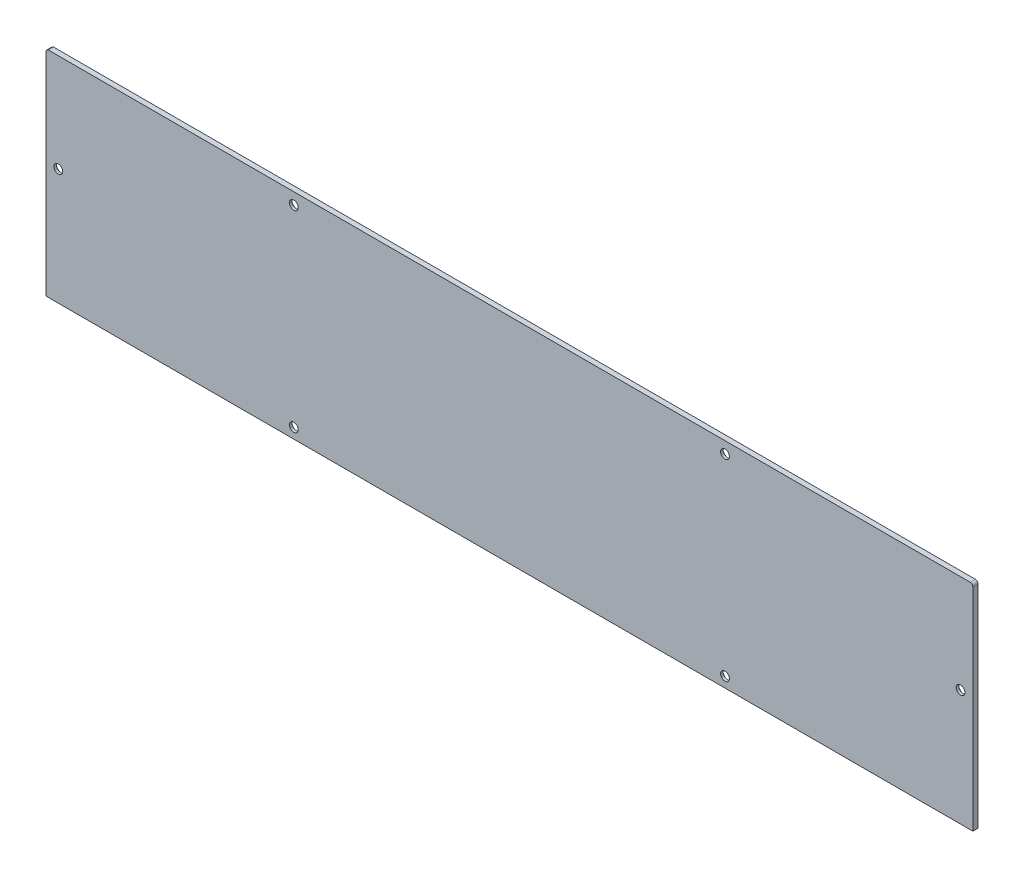
ISO-10303-21;
HEADER;
FILE_DESCRIPTION(('STEP AP214'),'2;1');
FILE_NAME('part.step','',(''),(''),'','','');
FILE_SCHEMA(('AUTOMOTIVE_DESIGN { 1 0 10303 214 1 1 1 1 }'));
ENDSEC;
DATA;
#1=APPLICATION_CONTEXT('core data for automotive mechanical design processes');
#2=APPLICATION_PROTOCOL_DEFINITION('international standard','automotive_design',2000,#1);
#3=PRODUCT_CONTEXT('',#1,'mechanical');
#4=PRODUCT('Part','Part','',(#3));
#5=PRODUCT_RELATED_PRODUCT_CATEGORY('part','',(#4));
#6=PRODUCT_DEFINITION_FORMATION('','',#4);
#7=PRODUCT_DEFINITION_CONTEXT('part definition',#1,'design');
#8=PRODUCT_DEFINITION('design','',#6,#7);
#9=PRODUCT_DEFINITION_SHAPE('','',#8);
#10=(LENGTH_UNIT() NAMED_UNIT(*) SI_UNIT(.MILLI.,.METRE.));
#11=(NAMED_UNIT(*) PLANE_ANGLE_UNIT() SI_UNIT($,.RADIAN.));
#12=(NAMED_UNIT(*) SI_UNIT($,.STERADIAN.) SOLID_ANGLE_UNIT());
#13=UNCERTAINTY_MEASURE_WITH_UNIT(LENGTH_MEASURE(1.E-05),#10,'distance_accuracy_value','');
#14=(GEOMETRIC_REPRESENTATION_CONTEXT(3) GLOBAL_UNCERTAINTY_ASSIGNED_CONTEXT((#13)) GLOBAL_UNIT_ASSIGNED_CONTEXT((#10,
#11,#12)) REPRESENTATION_CONTEXT('',''));
#15=CARTESIAN_POINT('',(0.,0.,0.));
#16=DIRECTION('',(0.,0.,1.));
#17=DIRECTION('',(1.,0.,0.));
#18=AXIS2_PLACEMENT_3D('',#15,#16,#17);
#19=CARTESIAN_POINT('',(76.2518692933662,-10.,220.724508868488));
#20=DIRECTION('',(0.,1.,0.));
#21=DIRECTION('',(-1.,0.,0.));
#22=AXIS2_PLACEMENT_3D('',#19,#20,#21);
#23=PLANE('',#22);
#24=DIRECTION('',(-1.,0.,0.));
#25=VECTOR('',#24,1.);
#26=CARTESIAN_POINT('',(76.2518692933662,-10.,222.724508868488));
#27=LINE('',#26,#25);
#28=CARTESIAN_POINT('',(76.2518692933662,-9.99999999999999,222.724508868488));
#29=VERTEX_POINT('',#28);
#30=CARTESIAN_POINT('',(-282.750233779396,-9.99999999999996,222.724508868488));
#31=VERTEX_POINT('',#30);
#32=EDGE_CURVE('E43',#29,#31,#27,.T.);
#33=ORIENTED_EDGE('',*,*,#32,.T.);
#34=DIRECTION('',(0.,0.,-1.));
#35=VECTOR('',#34,1.);
#36=CARTESIAN_POINT('',(-282.750233779396,-9.99999999999996,591.19636669574));
#37=LINE('',#36,#35);
#38=CARTESIAN_POINT('',(-282.750233779396,-9.99999999999996,220.724508868488));
#39=VERTEX_POINT('',#38);
#40=EDGE_CURVE('E99',#31,#39,#37,.T.);
#41=ORIENTED_EDGE('',*,*,#40,.T.);
#42=DIRECTION('',(-1.,0.,0.));
#43=VECTOR('',#42,1.);
#44=CARTESIAN_POINT('',(76.2518692933662,-10.,220.724508868488));
#45=LINE('',#44,#43);
#46=CARTESIAN_POINT('',(76.2518692933662,-9.99999999999999,220.724508868488));
#47=VERTEX_POINT('',#46);
#48=EDGE_CURVE('E11',#47,#39,#45,.T.);
#49=ORIENTED_EDGE('',*,*,#48,.F.);
#50=DIRECTION('',(0.,0.,-1.));
#51=VECTOR('',#50,1.);
#52=CARTESIAN_POINT('',(76.2518692933661,-9.99999999999999,591.19636669574));
#53=LINE('',#52,#51);
#54=EDGE_CURVE('E121',#29,#47,#53,.T.);
#55=ORIENTED_EDGE('',*,*,#54,.F.);
#56=EDGE_LOOP('',(#33,#41,#49,#55));
#57=FACE_BOUND('',#56,.T.);
#58=ADVANCED_FACE('F35',(#57),#23,.F.);
#59=CARTESIAN_POINT('',(73.2518692933661,70.,220.724508868488));
#60=DIRECTION('',(0.,0.,-1.));
#61=DIRECTION('',(-1.,0.,0.));
#62=AXIS2_PLACEMENT_3D('',#59,#60,#61);
#63=PLANE('',#62);
#64=ORIENTED_EDGE('',*,*,#48,.T.);
#65=DIRECTION('',(0.,1.,0.));
#66=VECTOR('',#65,1.);
#67=CARTESIAN_POINT('',(-282.750233779396,-9.99999999999996,220.724508868488));
#68=LINE('',#67,#66);
#69=CARTESIAN_POINT('',(-282.750233779396,72.,220.724508868488));
#70=VERTEX_POINT('',#69);
#71=EDGE_CURVE('E91',#39,#70,#68,.T.);
#72=ORIENTED_EDGE('',*,*,#71,.T.);
#73=CARTESIAN_POINT('',(-281.750233779396,72.,220.724508868488));
#74=DIRECTION('',(0.,0.,-1.));
#75=DIRECTION('',(-1.,0.,0.));
#76=AXIS2_PLACEMENT_3D('',#73,#74,#75);
#77=CIRCLE('',#76,1.);
#78=CARTESIAN_POINT('',(-281.750233779396,73.,220.724508868488));
#79=VERTEX_POINT('',#78);
#80=EDGE_CURVE('E108',#70,#79,#77,.T.);
#81=ORIENTED_EDGE('',*,*,#80,.T.);
#82=DIRECTION('',(1.,0.,0.));
#83=VECTOR('',#82,1.);
#84=CARTESIAN_POINT('',(-281.750233779396,73.,220.724508868488));
#85=LINE('',#84,#83);
#86=CARTESIAN_POINT('',(75.2518692933662,73.,220.724508868488));
#87=VERTEX_POINT('',#86);
#88=EDGE_CURVE('E110',#79,#87,#85,.T.);
#89=ORIENTED_EDGE('',*,*,#88,.T.);
#90=CARTESIAN_POINT('',(75.2518692933662,72.,220.724508868488));
#91=DIRECTION('',(0.,0.,-1.));
#92=DIRECTION('',(1.,0.,0.));
#93=AXIS2_PLACEMENT_3D('',#90,#91,#92);
#94=CIRCLE('',#93,1.);
#95=CARTESIAN_POINT('',(76.2518692933662,72.,220.724508868488));
#96=VERTEX_POINT('',#95);
#97=EDGE_CURVE('E118',#87,#96,#94,.T.);
#98=ORIENTED_EDGE('',*,*,#97,.T.);
#99=DIRECTION('',(0.,-1.,0.));
#100=VECTOR('',#99,1.);
#101=CARTESIAN_POINT('',(76.2518692933662,72.,220.724508868488));
#102=LINE('',#101,#100);
#103=EDGE_CURVE('E94',#96,#47,#102,.T.);
#104=ORIENTED_EDGE('',*,*,#103,.T.);
#105=EDGE_LOOP('',(#64,#72,#81,#89,#98,#104));
#106=FACE_BOUND('',#105,.T.);
#107=CARTESIAN_POINT('',(-19.7491822429967,-6.0000000000002,220.724508868478));
#108=DIRECTION('',(0.,0.,-1.));
#109=DIRECTION('',(-1.,0.,0.));
#110=AXIS2_PLACEMENT_3D('',#107,#108,#109);
#111=CIRCLE('',#110,3.);
#112=CARTESIAN_POINT('',(-22.7491822429967,-6.0000000000002,220.724508868478));
#113=VERTEX_POINT('',#112);
#114=EDGE_CURVE('E133',#113,#113,#111,.T.);
#115=ORIENTED_EDGE('',*,*,#114,.F.);
#116=EDGE_LOOP('',(#115));
#117=FACE_BOUND('',#116,.T.);
#118=CARTESIAN_POINT('',(-186.749182242997,-6.0000000000002,220.724508868478));
#119=DIRECTION('',(0.,0.,-1.));
#120=DIRECTION('',(-1.,0.,0.));
#121=AXIS2_PLACEMENT_3D('',#118,#119,#120);
#122=CIRCLE('',#121,3.);
#123=CARTESIAN_POINT('',(-189.749182242997,-6.0000000000002,220.724508868478));
#124=VERTEX_POINT('',#123);
#125=EDGE_CURVE('E142',#124,#124,#122,.T.);
#126=ORIENTED_EDGE('',*,*,#125,.F.);
#127=EDGE_LOOP('',(#126));
#128=FACE_BOUND('',#127,.T.);
#129=CARTESIAN_POINT('',(71.5018692933754,34.9999999999999,220.724508868488));
#130=DIRECTION('',(0.,0.,-1.));
#131=DIRECTION('',(-1.,0.,0.));
#132=AXIS2_PLACEMENT_3D('',#129,#130,#131);
#133=CIRCLE('',#132,3.);
#134=CARTESIAN_POINT('',(68.5018692933754,34.9999999999999,220.724508868488));
#135=VERTEX_POINT('',#134);
#136=EDGE_CURVE('E152',#135,#135,#133,.T.);
#137=ORIENTED_EDGE('',*,*,#136,.F.);
#138=EDGE_LOOP('',(#137));
#139=FACE_BOUND('',#138,.T.);
#140=CARTESIAN_POINT('',(-19.7491822430078,68.5,220.724508868488));
#141=DIRECTION('',(0.,0.,-1.));
#142=DIRECTION('',(-1.,0.,0.));
#143=AXIS2_PLACEMENT_3D('',#140,#141,#142);
#144=CIRCLE('',#143,3.);
#145=CARTESIAN_POINT('',(-22.7491822430078,68.5,220.724508868488));
#146=VERTEX_POINT('',#145);
#147=EDGE_CURVE('E162',#146,#146,#144,.T.);
#148=ORIENTED_EDGE('',*,*,#147,.F.);
#149=EDGE_LOOP('',(#148));
#150=FACE_BOUND('',#149,.T.);
#151=CARTESIAN_POINT('',(-186.749182243015,68.4999999999999,220.724508868488));
#152=DIRECTION('',(0.,0.,-1.));
#153=DIRECTION('',(-1.,0.,0.));
#154=AXIS2_PLACEMENT_3D('',#151,#152,#153);
#155=CIRCLE('',#154,3.);
#156=CARTESIAN_POINT('',(-189.749182243015,68.4999999999999,220.724508868488));
#157=VERTEX_POINT('',#156);
#158=EDGE_CURVE('E172',#157,#157,#155,.T.);
#159=ORIENTED_EDGE('',*,*,#158,.F.);
#160=EDGE_LOOP('',(#159));
#161=FACE_BOUND('',#160,.T.);
#162=CARTESIAN_POINT('',(-278.000233779387,35.,220.724508868488));
#163=DIRECTION('',(0.,0.,-1.));
#164=DIRECTION('',(-1.,0.,0.));
#165=AXIS2_PLACEMENT_3D('',#162,#163,#164);
#166=CIRCLE('',#165,3.);
#167=CARTESIAN_POINT('',(-281.000233779387,35.,220.724508868488));
#168=VERTEX_POINT('',#167);
#169=EDGE_CURVE('E182',#168,#168,#166,.T.);
#170=ORIENTED_EDGE('',*,*,#169,.F.);
#171=EDGE_LOOP('',(#170));
#172=FACE_BOUND('',#171,.T.);
#173=ADVANCED_FACE('F87',(#106,#117,#128,#139,#150,#161,#172),#63,.T.);
#174=CARTESIAN_POINT('',(73.2518692933661,70.,222.724508868488));
#175=DIRECTION('',(0.,0.,-1.));
#176=DIRECTION('',(-1.,0.,0.));
#177=AXIS2_PLACEMENT_3D('',#174,#175,#176);
#178=PLANE('',#177);
#179=DIRECTION('',(0.,-1.,0.));
#180=VECTOR('',#179,1.);
#181=CARTESIAN_POINT('',(-282.750233779396,-9.99999999999996,222.724508868488));
#182=LINE('',#181,#180);
#183=CARTESIAN_POINT('',(-282.750233779396,72.,222.724508868488));
#184=VERTEX_POINT('',#183);
#185=EDGE_CURVE('E131',#184,#31,#182,.T.);
#186=ORIENTED_EDGE('',*,*,#185,.T.);
#187=ORIENTED_EDGE('',*,*,#32,.F.);
#188=DIRECTION('',(0.,1.,0.));
#189=VECTOR('',#188,1.);
#190=CARTESIAN_POINT('',(76.2518692933662,72.,222.724508868488));
#191=LINE('',#190,#189);
#192=CARTESIAN_POINT('',(76.2518692933662,72.,222.724508868488));
#193=VERTEX_POINT('',#192);
#194=EDGE_CURVE('E113',#29,#193,#191,.T.);
#195=ORIENTED_EDGE('',*,*,#194,.T.);
#196=CARTESIAN_POINT('',(75.2518692933662,72.,222.724508868488));
#197=DIRECTION('',(0.,0.,-1.));
#198=DIRECTION('',(-1.,0.,0.));
#199=AXIS2_PLACEMENT_3D('',#196,#197,#198);
#200=CIRCLE('',#199,1.);
#201=CARTESIAN_POINT('',(75.2518692933662,73.,222.724508868488));
#202=VERTEX_POINT('',#201);
#203=EDGE_CURVE('E56',#193,#202,#200,.F.);
#204=ORIENTED_EDGE('',*,*,#203,.T.);
#205=DIRECTION('',(-1.,0.,0.));
#206=VECTOR('',#205,1.);
#207=CARTESIAN_POINT('',(-281.750233779396,73.,222.724508868488));
#208=LINE('',#207,#206);
#209=CARTESIAN_POINT('',(-281.750233779396,73.,222.724508868488));
#210=VERTEX_POINT('',#209);
#211=EDGE_CURVE('E51',#202,#210,#208,.T.);
#212=ORIENTED_EDGE('',*,*,#211,.T.);
#213=CARTESIAN_POINT('',(-281.750233779396,72.,222.724508868488));
#214=DIRECTION('',(0.,0.,-1.));
#215=DIRECTION('',(-1.,0.,0.));
#216=AXIS2_PLACEMENT_3D('',#213,#214,#215);
#217=CIRCLE('',#216,1.);
#218=EDGE_CURVE('E123',#210,#184,#217,.F.);
#219=ORIENTED_EDGE('',*,*,#218,.T.);
#220=EDGE_LOOP('',(#186,#187,#195,#204,#212,#219));
#221=FACE_BOUND('',#220,.T.);
#222=CARTESIAN_POINT('',(-19.7491822429967,-6.0000000000002,222.724508868488));
#223=DIRECTION('',(0.,0.,-1.));
#224=DIRECTION('',(-1.,0.,0.));
#225=AXIS2_PLACEMENT_3D('',#222,#223,#224);
#226=CIRCLE('',#225,1.7);
#227=CARTESIAN_POINT('',(-21.4491822429967,-6.0000000000002,222.724508868488));
#228=VERTEX_POINT('',#227);
#229=EDGE_CURVE('E38',#228,#228,#226,.T.);
#230=ORIENTED_EDGE('',*,*,#229,.T.);
#231=EDGE_LOOP('',(#230));
#232=FACE_BOUND('',#231,.T.);
#233=CARTESIAN_POINT('',(-186.749182242997,-6.0000000000002,222.724508868488));
#234=DIRECTION('',(0.,0.,-1.));
#235=DIRECTION('',(-1.,0.,0.));
#236=AXIS2_PLACEMENT_3D('',#233,#234,#235);
#237=CIRCLE('',#236,1.70000000000001);
#238=CARTESIAN_POINT('',(-188.449182242997,-6.0000000000002,222.724508868488));
#239=VERTEX_POINT('',#238);
#240=EDGE_CURVE('E151',#239,#239,#237,.T.);
#241=ORIENTED_EDGE('',*,*,#240,.T.);
#242=EDGE_LOOP('',(#241));
#243=FACE_BOUND('',#242,.T.);
#244=CARTESIAN_POINT('',(71.5018692933754,34.9999999999999,222.724508868488));
#245=DIRECTION('',(0.,0.,-1.));
#246=DIRECTION('',(-1.,0.,0.));
#247=AXIS2_PLACEMENT_3D('',#244,#245,#246);
#248=CIRCLE('',#247,1.69999999999999);
#249=CARTESIAN_POINT('',(69.8018692933754,34.9999999999999,222.724508868488));
#250=VERTEX_POINT('',#249);
#251=EDGE_CURVE('E161',#250,#250,#248,.T.);
#252=ORIENTED_EDGE('',*,*,#251,.T.);
#253=EDGE_LOOP('',(#252));
#254=FACE_BOUND('',#253,.T.);
#255=CARTESIAN_POINT('',(-19.7491822430078,68.5,222.724508868488));
#256=DIRECTION('',(0.,0.,-1.));
#257=DIRECTION('',(-1.,0.,0.));
#258=AXIS2_PLACEMENT_3D('',#255,#256,#257);
#259=CIRCLE('',#258,1.7);
#260=CARTESIAN_POINT('',(-21.4491822430078,68.5,222.724508868488));
#261=VERTEX_POINT('',#260);
#262=EDGE_CURVE('E171',#261,#261,#259,.T.);
#263=ORIENTED_EDGE('',*,*,#262,.T.);
#264=EDGE_LOOP('',(#263));
#265=FACE_BOUND('',#264,.T.);
#266=CARTESIAN_POINT('',(-186.749182243015,68.4999999999999,222.724508868488));
#267=DIRECTION('',(0.,0.,-1.));
#268=DIRECTION('',(-1.,0.,0.));
#269=AXIS2_PLACEMENT_3D('',#266,#267,#268);
#270=CIRCLE('',#269,1.70000000000001);
#271=CARTESIAN_POINT('',(-188.449182243015,68.4999999999999,222.724508868488));
#272=VERTEX_POINT('',#271);
#273=EDGE_CURVE('E181',#272,#272,#270,.T.);
#274=ORIENTED_EDGE('',*,*,#273,.T.);
#275=EDGE_LOOP('',(#274));
#276=FACE_BOUND('',#275,.T.);
#277=CARTESIAN_POINT('',(-278.000233779387,35.,222.724508868488));
#278=DIRECTION('',(0.,0.,-1.));
#279=DIRECTION('',(-1.,0.,0.));
#280=AXIS2_PLACEMENT_3D('',#277,#278,#279);
#281=CIRCLE('',#280,1.69999999999998);
#282=CARTESIAN_POINT('',(-279.700233779387,35.,222.724508868488));
#283=VERTEX_POINT('',#282);
#284=EDGE_CURVE('E190',#283,#283,#281,.T.);
#285=ORIENTED_EDGE('',*,*,#284,.T.);
#286=EDGE_LOOP('',(#285));
#287=FACE_BOUND('',#286,.T.);
#288=ADVANCED_FACE('F203',(#221,#232,#243,#254,#265,#276,#287),#178,.F.);
#289=CARTESIAN_POINT('',(-278.000233779387,35.,220.724508868488));
#290=DIRECTION('',(0.,0.,-1.));
#291=DIRECTION('',(-1.,0.,0.));
#292=AXIS2_PLACEMENT_3D('',#289,#290,#291);
#293=CYLINDRICAL_SURFACE('',#292,1.69999999999998);
#294=CARTESIAN_POINT('',(-278.000233779387,35.,221.724508868488));
#295=DIRECTION('',(0.,0.,-1.));
#296=DIRECTION('',(-1.,0.,0.));
#297=AXIS2_PLACEMENT_3D('',#294,#295,#296);
#298=CIRCLE('',#297,1.69999999999998);
#299=CARTESIAN_POINT('',(-279.700233779387,35.,221.724508868488));
#300=VERTEX_POINT('',#299);
#301=EDGE_CURVE('E188',#300,#300,#298,.T.);
#302=ORIENTED_EDGE('',*,*,#301,.T.);
#303=EDGE_LOOP('',(#302));
#304=FACE_BOUND('',#303,.T.);
#305=ORIENTED_EDGE('',*,*,#284,.F.);
#306=EDGE_LOOP('',(#305));
#307=FACE_BOUND('',#306,.T.);
#308=ADVANCED_FACE('F230',(#304,#307),#293,.F.);
#309=CARTESIAN_POINT('',(-276.300233779387,35.,221.724508868488));
#310=DIRECTION('',(0.,0.,1.));
#311=DIRECTION('',(1.,0.,0.));
#312=AXIS2_PLACEMENT_3D('',#309,#310,#311);
#313=PLANE('',#312);
#314=ORIENTED_EDGE('',*,*,#301,.F.);
#315=EDGE_LOOP('',(#314));
#316=FACE_BOUND('',#315,.T.);
#317=CARTESIAN_POINT('',(-278.000233779387,35.,221.724508868488));
#318=DIRECTION('',(0.,0.,-1.));
#319=DIRECTION('',(-1.,0.,0.));
#320=AXIS2_PLACEMENT_3D('',#317,#318,#319);
#321=CIRCLE('',#320,3.);
#322=CARTESIAN_POINT('',(-281.000233779387,35.,221.724508868488));
#323=VERTEX_POINT('',#322);
#324=EDGE_CURVE('E185',#323,#323,#321,.T.);
#325=ORIENTED_EDGE('',*,*,#324,.T.);
#326=EDGE_LOOP('',(#325));
#327=FACE_BOUND('',#326,.T.);
#328=ADVANCED_FACE('F234',(#316,#327),#313,.F.);
#329=CARTESIAN_POINT('',(-278.000233779387,35.,220.724508868488));
#330=DIRECTION('',(0.,0.,-1.));
#331=DIRECTION('',(-1.,0.,0.));
#332=AXIS2_PLACEMENT_3D('',#329,#330,#331);
#333=CYLINDRICAL_SURFACE('',#332,3.);
#334=ORIENTED_EDGE('',*,*,#324,.F.);
#335=EDGE_LOOP('',(#334));
#336=FACE_BOUND('',#335,.T.);
#337=ORIENTED_EDGE('',*,*,#169,.T.);
#338=EDGE_LOOP('',(#337));
#339=FACE_BOUND('',#338,.T.);
#340=ADVANCED_FACE('F238',(#336,#339),#333,.F.);
#341=CARTESIAN_POINT('',(-186.749182243015,68.4999999999999,220.724508868488));
#342=DIRECTION('',(0.,0.,-1.));
#343=DIRECTION('',(-1.,0.,0.));
#344=AXIS2_PLACEMENT_3D('',#341,#342,#343);
#345=CYLINDRICAL_SURFACE('',#344,1.70000000000001);
#346=CARTESIAN_POINT('',(-186.749182243015,68.4999999999999,221.724508868488));
#347=DIRECTION('',(0.,0.,-1.));
#348=DIRECTION('',(-1.,0.,0.));
#349=AXIS2_PLACEMENT_3D('',#346,#347,#348);
#350=CIRCLE('',#349,1.70000000000001);
#351=CARTESIAN_POINT('',(-188.449182243015,68.4999999999999,221.724508868488));
#352=VERTEX_POINT('',#351);
#353=EDGE_CURVE('E178',#352,#352,#350,.T.);
#354=ORIENTED_EDGE('',*,*,#353,.T.);
#355=EDGE_LOOP('',(#354));
#356=FACE_BOUND('',#355,.T.);
#357=ORIENTED_EDGE('',*,*,#273,.F.);
#358=EDGE_LOOP('',(#357));
#359=FACE_BOUND('',#358,.T.);
#360=ADVANCED_FACE('F242',(#356,#359),#345,.F.);
#361=CARTESIAN_POINT('',(-185.049182243015,68.4999999999999,221.724508868488));
#362=DIRECTION('',(0.,0.,1.));
#363=DIRECTION('',(1.,0.,0.));
#364=AXIS2_PLACEMENT_3D('',#361,#362,#363);
#365=PLANE('',#364);
#366=ORIENTED_EDGE('',*,*,#353,.F.);
#367=EDGE_LOOP('',(#366));
#368=FACE_BOUND('',#367,.T.);
#369=CARTESIAN_POINT('',(-186.749182243015,68.4999999999999,221.724508868488));
#370=DIRECTION('',(0.,0.,-1.));
#371=DIRECTION('',(-1.,0.,0.));
#372=AXIS2_PLACEMENT_3D('',#369,#370,#371);
#373=CIRCLE('',#372,3.);
#374=CARTESIAN_POINT('',(-189.749182243015,68.4999999999999,221.724508868488));
#375=VERTEX_POINT('',#374);
#376=EDGE_CURVE('E175',#375,#375,#373,.T.);
#377=ORIENTED_EDGE('',*,*,#376,.T.);
#378=EDGE_LOOP('',(#377));
#379=FACE_BOUND('',#378,.T.);
#380=ADVANCED_FACE('F246',(#368,#379),#365,.F.);
#381=CARTESIAN_POINT('',(-186.749182243015,68.4999999999999,220.724508868488));
#382=DIRECTION('',(0.,0.,-1.));
#383=DIRECTION('',(-1.,0.,0.));
#384=AXIS2_PLACEMENT_3D('',#381,#382,#383);
#385=CYLINDRICAL_SURFACE('',#384,3.);
#386=ORIENTED_EDGE('',*,*,#376,.F.);
#387=EDGE_LOOP('',(#386));
#388=FACE_BOUND('',#387,.T.);
#389=ORIENTED_EDGE('',*,*,#158,.T.);
#390=EDGE_LOOP('',(#389));
#391=FACE_BOUND('',#390,.T.);
#392=ADVANCED_FACE('F250',(#388,#391),#385,.F.);
#393=CARTESIAN_POINT('',(-19.7491822430078,68.5,220.724508868488));
#394=DIRECTION('',(0.,0.,-1.));
#395=DIRECTION('',(-1.,0.,0.));
#396=AXIS2_PLACEMENT_3D('',#393,#394,#395);
#397=CYLINDRICAL_SURFACE('',#396,1.7);
#398=CARTESIAN_POINT('',(-19.7491822430078,68.5,221.724508868488));
#399=DIRECTION('',(0.,0.,-1.));
#400=DIRECTION('',(-1.,0.,0.));
#401=AXIS2_PLACEMENT_3D('',#398,#399,#400);
#402=CIRCLE('',#401,1.7);
#403=CARTESIAN_POINT('',(-21.4491822430078,68.5,221.724508868488));
#404=VERTEX_POINT('',#403);
#405=EDGE_CURVE('E168',#404,#404,#402,.T.);
#406=ORIENTED_EDGE('',*,*,#405,.T.);
#407=EDGE_LOOP('',(#406));
#408=FACE_BOUND('',#407,.T.);
#409=ORIENTED_EDGE('',*,*,#262,.F.);
#410=EDGE_LOOP('',(#409));
#411=FACE_BOUND('',#410,.T.);
#412=ADVANCED_FACE('F254',(#408,#411),#397,.F.);
#413=CARTESIAN_POINT('',(-18.0491822430078,68.5,221.724508868488));
#414=DIRECTION('',(0.,0.,1.));
#415=DIRECTION('',(1.,0.,0.));
#416=AXIS2_PLACEMENT_3D('',#413,#414,#415);
#417=PLANE('',#416);
#418=ORIENTED_EDGE('',*,*,#405,.F.);
#419=EDGE_LOOP('',(#418));
#420=FACE_BOUND('',#419,.T.);
#421=CARTESIAN_POINT('',(-19.7491822430078,68.5,221.724508868488));
#422=DIRECTION('',(0.,0.,-1.));
#423=DIRECTION('',(-1.,0.,0.));
#424=AXIS2_PLACEMENT_3D('',#421,#422,#423);
#425=CIRCLE('',#424,3.);
#426=CARTESIAN_POINT('',(-22.7491822430078,68.5,221.724508868488));
#427=VERTEX_POINT('',#426);
#428=EDGE_CURVE('E165',#427,#427,#425,.T.);
#429=ORIENTED_EDGE('',*,*,#428,.T.);
#430=EDGE_LOOP('',(#429));
#431=FACE_BOUND('',#430,.T.);
#432=ADVANCED_FACE('F258',(#420,#431),#417,.F.);
#433=CARTESIAN_POINT('',(-19.7491822430078,68.5,220.724508868488));
#434=DIRECTION('',(0.,0.,-1.));
#435=DIRECTION('',(-1.,0.,0.));
#436=AXIS2_PLACEMENT_3D('',#433,#434,#435);
#437=CYLINDRICAL_SURFACE('',#436,3.);
#438=ORIENTED_EDGE('',*,*,#428,.F.);
#439=EDGE_LOOP('',(#438));
#440=FACE_BOUND('',#439,.T.);
#441=ORIENTED_EDGE('',*,*,#147,.T.);
#442=EDGE_LOOP('',(#441));
#443=FACE_BOUND('',#442,.T.);
#444=ADVANCED_FACE('F262',(#440,#443),#437,.F.);
#445=CARTESIAN_POINT('',(71.5018692933754,34.9999999999999,220.724508868488));
#446=DIRECTION('',(0.,0.,-1.));
#447=DIRECTION('',(-1.,0.,0.));
#448=AXIS2_PLACEMENT_3D('',#445,#446,#447);
#449=CYLINDRICAL_SURFACE('',#448,1.69999999999999);
#450=CARTESIAN_POINT('',(71.5018692933754,34.9999999999999,221.724508868488));
#451=DIRECTION('',(0.,0.,-1.));
#452=DIRECTION('',(-1.,0.,0.));
#453=AXIS2_PLACEMENT_3D('',#450,#451,#452);
#454=CIRCLE('',#453,1.69999999999999);
#455=CARTESIAN_POINT('',(69.8018692933754,34.9999999999999,221.724508868488));
#456=VERTEX_POINT('',#455);
#457=EDGE_CURVE('E158',#456,#456,#454,.T.);
#458=ORIENTED_EDGE('',*,*,#457,.T.);
#459=EDGE_LOOP('',(#458));
#460=FACE_BOUND('',#459,.T.);
#461=ORIENTED_EDGE('',*,*,#251,.F.);
#462=EDGE_LOOP('',(#461));
#463=FACE_BOUND('',#462,.T.);
#464=ADVANCED_FACE('F266',(#460,#463),#449,.F.);
#465=CARTESIAN_POINT('',(73.2018692933754,34.9999999999999,221.724508868488));
#466=DIRECTION('',(0.,0.,1.));
#467=DIRECTION('',(1.,0.,0.));
#468=AXIS2_PLACEMENT_3D('',#465,#466,#467);
#469=PLANE('',#468);
#470=ORIENTED_EDGE('',*,*,#457,.F.);
#471=EDGE_LOOP('',(#470));
#472=FACE_BOUND('',#471,.T.);
#473=CARTESIAN_POINT('',(71.5018692933754,34.9999999999999,221.724508868488));
#474=DIRECTION('',(0.,0.,-1.));
#475=DIRECTION('',(-1.,0.,0.));
#476=AXIS2_PLACEMENT_3D('',#473,#474,#475);
#477=CIRCLE('',#476,3.);
#478=CARTESIAN_POINT('',(68.5018692933754,34.9999999999999,221.724508868488));
#479=VERTEX_POINT('',#478);
#480=EDGE_CURVE('E155',#479,#479,#477,.T.);
#481=ORIENTED_EDGE('',*,*,#480,.T.);
#482=EDGE_LOOP('',(#481));
#483=FACE_BOUND('',#482,.T.);
#484=ADVANCED_FACE('F219',(#472,#483),#469,.F.);
#485=CARTESIAN_POINT('',(71.5018692933754,34.9999999999999,220.724508868488));
#486=DIRECTION('',(0.,0.,-1.));
#487=DIRECTION('',(-1.,0.,0.));
#488=AXIS2_PLACEMENT_3D('',#485,#486,#487);
#489=CYLINDRICAL_SURFACE('',#488,3.);
#490=ORIENTED_EDGE('',*,*,#480,.F.);
#491=EDGE_LOOP('',(#490));
#492=FACE_BOUND('',#491,.T.);
#493=ORIENTED_EDGE('',*,*,#136,.T.);
#494=EDGE_LOOP('',(#493));
#495=FACE_BOUND('',#494,.T.);
#496=ADVANCED_FACE('F209',(#492,#495),#489,.F.);
#497=CARTESIAN_POINT('',(-186.749182242997,-6.0000000000002,220.724508868478));
#498=DIRECTION('',(0.,0.,-1.));
#499=DIRECTION('',(-1.,0.,0.));
#500=AXIS2_PLACEMENT_3D('',#497,#498,#499);
#501=CYLINDRICAL_SURFACE('',#500,1.70000000000001);
#502=CARTESIAN_POINT('',(-186.749182242997,-6.0000000000002,221.724508868478));
#503=DIRECTION('',(0.,0.,-1.));
#504=DIRECTION('',(-1.,0.,0.));
#505=AXIS2_PLACEMENT_3D('',#502,#503,#504);
#506=CIRCLE('',#505,1.70000000000001);
#507=CARTESIAN_POINT('',(-188.449182242997,-6.0000000000002,221.724508868478));
#508=VERTEX_POINT('',#507);
#509=EDGE_CURVE('E148',#508,#508,#506,.T.);
#510=ORIENTED_EDGE('',*,*,#509,.T.);
#511=EDGE_LOOP('',(#510));
#512=FACE_BOUND('',#511,.T.);
#513=ORIENTED_EDGE('',*,*,#240,.F.);
#514=EDGE_LOOP('',(#513));
#515=FACE_BOUND('',#514,.T.);
#516=ADVANCED_FACE('F206',(#512,#515),#501,.F.);
#517=CARTESIAN_POINT('',(-185.049182242997,-6.0000000000002,221.724508868478));
#518=DIRECTION('',(0.,0.,1.));
#519=DIRECTION('',(1.,0.,0.));
#520=AXIS2_PLACEMENT_3D('',#517,#518,#519);
#521=PLANE('',#520);
#522=ORIENTED_EDGE('',*,*,#509,.F.);
#523=EDGE_LOOP('',(#522));
#524=FACE_BOUND('',#523,.T.);
#525=CARTESIAN_POINT('',(-186.749182242997,-6.0000000000002,221.724508868478));
#526=DIRECTION('',(0.,0.,-1.));
#527=DIRECTION('',(-1.,0.,0.));
#528=AXIS2_PLACEMENT_3D('',#525,#526,#527);
#529=CIRCLE('',#528,3.);
#530=CARTESIAN_POINT('',(-189.749182242997,-6.0000000000002,221.724508868478));
#531=VERTEX_POINT('',#530);
#532=EDGE_CURVE('E145',#531,#531,#529,.T.);
#533=ORIENTED_EDGE('',*,*,#532,.T.);
#534=EDGE_LOOP('',(#533));
#535=FACE_BOUND('',#534,.T.);
#536=ADVANCED_FACE('F208',(#524,#535),#521,.F.);
#537=CARTESIAN_POINT('',(-186.749182242997,-6.0000000000002,220.724508868478));
#538=DIRECTION('',(0.,0.,-1.));
#539=DIRECTION('',(-1.,0.,0.));
#540=AXIS2_PLACEMENT_3D('',#537,#538,#539);
#541=CYLINDRICAL_SURFACE('',#540,3.);
#542=ORIENTED_EDGE('',*,*,#532,.F.);
#543=EDGE_LOOP('',(#542));
#544=FACE_BOUND('',#543,.T.);
#545=ORIENTED_EDGE('',*,*,#125,.T.);
#546=EDGE_LOOP('',(#545));
#547=FACE_BOUND('',#546,.T.);
#548=ADVANCED_FACE('F216',(#544,#547),#541,.F.);
#549=CARTESIAN_POINT('',(-19.7491822429967,-6.0000000000002,220.724508868478));
#550=DIRECTION('',(0.,0.,-1.));
#551=DIRECTION('',(-1.,0.,0.));
#552=AXIS2_PLACEMENT_3D('',#549,#550,#551);
#553=CYLINDRICAL_SURFACE('',#552,1.7);
#554=CARTESIAN_POINT('',(-19.7491822429967,-6.0000000000002,221.724508868478));
#555=DIRECTION('',(0.,0.,-1.));
#556=DIRECTION('',(-1.,0.,0.));
#557=AXIS2_PLACEMENT_3D('',#554,#555,#556);
#558=CIRCLE('',#557,1.7);
#559=CARTESIAN_POINT('',(-21.4491822429967,-6.0000000000002,221.724508868478));
#560=VERTEX_POINT('',#559);
#561=EDGE_CURVE('E139',#560,#560,#558,.T.);
#562=ORIENTED_EDGE('',*,*,#561,.T.);
#563=EDGE_LOOP('',(#562));
#564=FACE_BOUND('',#563,.T.);
#565=ORIENTED_EDGE('',*,*,#229,.F.);
#566=EDGE_LOOP('',(#565));
#567=FACE_BOUND('',#566,.T.);
#568=ADVANCED_FACE('F326',(#564,#567),#553,.F.);
#569=CARTESIAN_POINT('',(-18.0491822429967,-6.0000000000002,221.724508868478));
#570=DIRECTION('',(0.,0.,1.));
#571=DIRECTION('',(1.,0.,0.));
#572=AXIS2_PLACEMENT_3D('',#569,#570,#571);
#573=PLANE('',#572);
#574=ORIENTED_EDGE('',*,*,#561,.F.);
#575=EDGE_LOOP('',(#574));
#576=FACE_BOUND('',#575,.T.);
#577=CARTESIAN_POINT('',(-19.7491822429967,-6.0000000000002,221.724508868478));
#578=DIRECTION('',(0.,0.,-1.));
#579=DIRECTION('',(-1.,0.,0.));
#580=AXIS2_PLACEMENT_3D('',#577,#578,#579);
#581=CIRCLE('',#580,3.);
#582=CARTESIAN_POINT('',(-22.7491822429967,-6.0000000000002,221.724508868478));
#583=VERTEX_POINT('',#582);
#584=EDGE_CURVE('E136',#583,#583,#581,.T.);
#585=ORIENTED_EDGE('',*,*,#584,.T.);
#586=EDGE_LOOP('',(#585));
#587=FACE_BOUND('',#586,.T.);
#588=ADVANCED_FACE('F336',(#576,#587),#573,.F.);
#589=CARTESIAN_POINT('',(-19.7491822429967,-6.0000000000002,220.724508868478));
#590=DIRECTION('',(0.,0.,-1.));
#591=DIRECTION('',(-1.,0.,0.));
#592=AXIS2_PLACEMENT_3D('',#589,#590,#591);
#593=CYLINDRICAL_SURFACE('',#592,3.);
#594=ORIENTED_EDGE('',*,*,#584,.F.);
#595=EDGE_LOOP('',(#594));
#596=FACE_BOUND('',#595,.T.);
#597=ORIENTED_EDGE('',*,*,#114,.T.);
#598=EDGE_LOOP('',(#597));
#599=FACE_BOUND('',#598,.T.);
#600=ADVANCED_FACE('F346',(#596,#599),#593,.F.);
#601=CARTESIAN_POINT('',(76.2518692933661,72.,591.19636669574));
#602=DIRECTION('',(1.,0.,0.));
#603=DIRECTION('',(0.,0.,-1.));
#604=AXIS2_PLACEMENT_3D('',#601,#602,#603);
#605=PLANE('',#604);
#606=ORIENTED_EDGE('',*,*,#194,.F.);
#607=ORIENTED_EDGE('',*,*,#54,.T.);
#608=ORIENTED_EDGE('',*,*,#103,.F.);
#609=DIRECTION('',(0.,0.,-1.));
#610=VECTOR('',#609,1.);
#611=CARTESIAN_POINT('',(76.2518692933661,72.,591.19636669574));
#612=LINE('',#611,#610);
#613=EDGE_CURVE('E124',#193,#96,#612,.T.);
#614=ORIENTED_EDGE('',*,*,#613,.F.);
#615=EDGE_LOOP('',(#606,#607,#608,#614));
#616=FACE_BOUND('',#615,.T.);
#617=ADVANCED_FACE('F355',(#616),#605,.T.);
#618=CARTESIAN_POINT('',(75.2518692933661,72.,591.19636669574));
#619=DIRECTION('',(0.,0.,-1.));
#620=DIRECTION('',(-1.,0.,0.));
#621=AXIS2_PLACEMENT_3D('',#618,#619,#620);
#622=CYLINDRICAL_SURFACE('',#621,1.);
#623=ORIENTED_EDGE('',*,*,#203,.F.);
#624=ORIENTED_EDGE('',*,*,#613,.T.);
#625=ORIENTED_EDGE('',*,*,#97,.F.);
#626=DIRECTION('',(0.,0.,-1.));
#627=VECTOR('',#626,1.);
#628=CARTESIAN_POINT('',(75.2518692933661,73.,591.19636669574));
#629=LINE('',#628,#627);
#630=EDGE_CURVE('E126',#202,#87,#629,.T.);
#631=ORIENTED_EDGE('',*,*,#630,.F.);
#632=EDGE_LOOP('',(#623,#624,#625,#631));
#633=FACE_BOUND('',#632,.T.);
#634=ADVANCED_FACE('F383',(#633),#622,.T.);
#635=CARTESIAN_POINT('',(-281.750233779396,73.,591.19636669574));
#636=DIRECTION('',(0.,1.,0.));
#637=DIRECTION('',(0.,0.,1.));
#638=AXIS2_PLACEMENT_3D('',#635,#636,#637);
#639=PLANE('',#638);
#640=ORIENTED_EDGE('',*,*,#211,.F.);
#641=ORIENTED_EDGE('',*,*,#630,.T.);
#642=ORIENTED_EDGE('',*,*,#88,.F.);
#643=DIRECTION('',(0.,0.,-1.));
#644=VECTOR('',#643,1.);
#645=CARTESIAN_POINT('',(-281.750233779396,73.,591.19636669574));
#646=LINE('',#645,#644);
#647=EDGE_CURVE('E128',#210,#79,#646,.T.);
#648=ORIENTED_EDGE('',*,*,#647,.F.);
#649=EDGE_LOOP('',(#640,#641,#642,#648));
#650=FACE_BOUND('',#649,.T.);
#651=ADVANCED_FACE('F393',(#650),#639,.T.);
#652=CARTESIAN_POINT('',(-281.750233779396,72.,591.19636669574));
#653=DIRECTION('',(0.,0.,-1.));
#654=DIRECTION('',(-1.,0.,0.));
#655=AXIS2_PLACEMENT_3D('',#652,#653,#654);
#656=CYLINDRICAL_SURFACE('',#655,1.);
#657=ORIENTED_EDGE('',*,*,#218,.F.);
#658=ORIENTED_EDGE('',*,*,#647,.T.);
#659=ORIENTED_EDGE('',*,*,#80,.F.);
#660=DIRECTION('',(0.,0.,-1.));
#661=VECTOR('',#660,1.);
#662=CARTESIAN_POINT('',(-282.750233779396,72.,591.19636669574));
#663=LINE('',#662,#661);
#664=EDGE_CURVE('E103',#184,#70,#663,.T.);
#665=ORIENTED_EDGE('',*,*,#664,.F.);
#666=EDGE_LOOP('',(#657,#658,#659,#665));
#667=FACE_BOUND('',#666,.T.);
#668=ADVANCED_FACE('F403',(#667),#656,.T.);
#669=CARTESIAN_POINT('',(-282.750233779396,-9.99999999999996,591.19636669574));
#670=DIRECTION('',(-1.,0.,0.));
#671=DIRECTION('',(0.,0.,1.));
#672=AXIS2_PLACEMENT_3D('',#669,#670,#671);
#673=PLANE('',#672);
#674=ORIENTED_EDGE('',*,*,#185,.F.);
#675=ORIENTED_EDGE('',*,*,#664,.T.);
#676=ORIENTED_EDGE('',*,*,#71,.F.);
#677=ORIENTED_EDGE('',*,*,#40,.F.);
#678=EDGE_LOOP('',(#674,#675,#676,#677));
#679=FACE_BOUND('',#678,.T.);
#680=ADVANCED_FACE('F105',(#679),#673,.T.);
#681=CLOSED_SHELL('',(#58,#173,#288,#308,#328,#340,#360,#380,#392,#412,#432,#444,#464,#484,#496,
#516,#536,#548,#568,#588,#600,#617,#634,#651,#668,#680));
#682=MANIFOLD_SOLID_BREP('B2',#681);
#683=ADVANCED_BREP_SHAPE_REPRESENTATION('',(#18,#682),#14);
#684=SHAPE_DEFINITION_REPRESENTATION(#9,#683);
ENDSEC;
END-ISO-10303-21;
